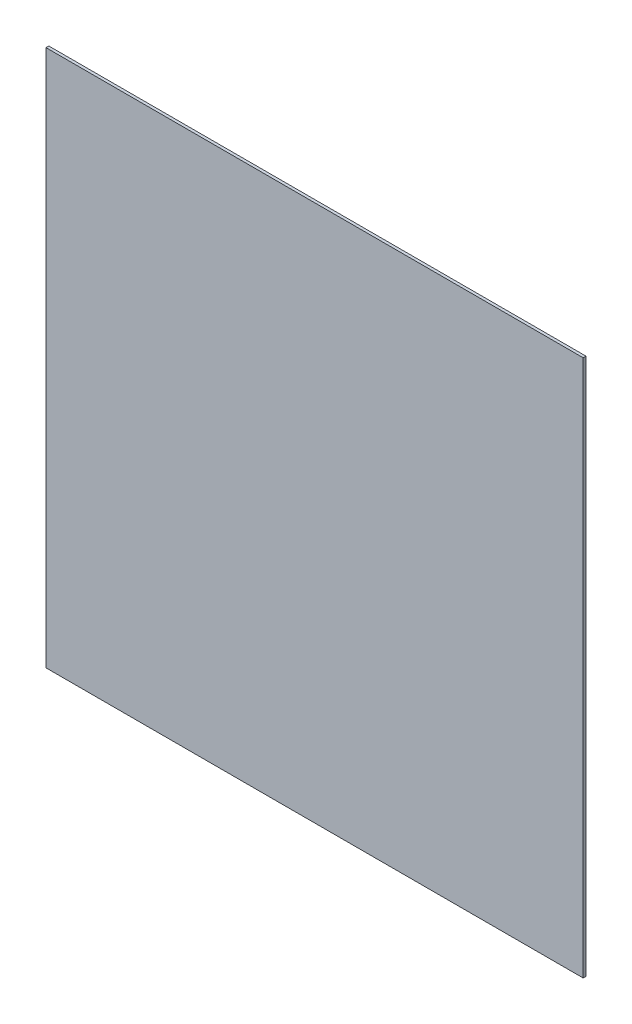
ISO-10303-21;
HEADER;
FILE_DESCRIPTION(('STEP AP214'),'2;1');
FILE_NAME('part.step','',(''),(''),'','','');
FILE_SCHEMA(('AUTOMOTIVE_DESIGN { 1 0 10303 214 1 1 1 1 }'));
ENDSEC;
DATA;
#1=APPLICATION_CONTEXT('core data for automotive mechanical design processes');
#2=APPLICATION_PROTOCOL_DEFINITION('international standard','automotive_design',2000,#1);
#3=PRODUCT_CONTEXT('',#1,'mechanical');
#4=PRODUCT('Part','Part','',(#3));
#5=PRODUCT_RELATED_PRODUCT_CATEGORY('part','',(#4));
#6=PRODUCT_DEFINITION_FORMATION('','',#4);
#7=PRODUCT_DEFINITION_CONTEXT('part definition',#1,'design');
#8=PRODUCT_DEFINITION('design','',#6,#7);
#9=PRODUCT_DEFINITION_SHAPE('','',#8);
#10=(LENGTH_UNIT() NAMED_UNIT(*) SI_UNIT(.MILLI.,.METRE.));
#11=(NAMED_UNIT(*) PLANE_ANGLE_UNIT() SI_UNIT($,.RADIAN.));
#12=(NAMED_UNIT(*) SI_UNIT($,.STERADIAN.) SOLID_ANGLE_UNIT());
#13=UNCERTAINTY_MEASURE_WITH_UNIT(LENGTH_MEASURE(1.E-05),#10,'distance_accuracy_value','');
#14=(GEOMETRIC_REPRESENTATION_CONTEXT(3) GLOBAL_UNCERTAINTY_ASSIGNED_CONTEXT((#13)) GLOBAL_UNIT_ASSIGNED_CONTEXT((#10,
#11,#12)) REPRESENTATION_CONTEXT('',''));
#15=CARTESIAN_POINT('',(0.,0.,0.));
#16=DIRECTION('',(0.,0.,1.));
#17=DIRECTION('',(1.,0.,0.));
#18=AXIS2_PLACEMENT_3D('',#15,#16,#17);
#19=CARTESIAN_POINT('',(-474.,474.,2.5));
#20=DIRECTION('',(1.,0.,0.));
#21=DIRECTION('',(0.,1.,0.));
#22=AXIS2_PLACEMENT_3D('',#19,#20,#21);
#23=PLANE('',#22);
#24=DIRECTION('',(0.,-1.,0.));
#25=VECTOR('',#24,1.);
#26=CARTESIAN_POINT('',(-474.,474.,0.));
#27=LINE('',#26,#25);
#28=CARTESIAN_POINT('',(-474.,474.,0.));
#29=VERTEX_POINT('',#28);
#30=CARTESIAN_POINT('',(-474.,0.,0.));
#31=VERTEX_POINT('',#30);
#32=EDGE_CURVE('E107',#29,#31,#27,.T.);
#33=ORIENTED_EDGE('',*,*,#32,.T.);
#34=DIRECTION('',(0.,0.,-1.));
#35=VECTOR('',#34,1.);
#36=CARTESIAN_POINT('',(-474.,0.,2.5));
#37=LINE('',#36,#35);
#38=CARTESIAN_POINT('',(-474.,0.,2.5));
#39=VERTEX_POINT('',#38);
#40=EDGE_CURVE('E11',#39,#31,#37,.T.);
#41=ORIENTED_EDGE('',*,*,#40,.F.);
#42=DIRECTION('',(0.,-1.,0.));
#43=VECTOR('',#42,1.);
#44=CARTESIAN_POINT('',(-474.,474.,2.5));
#45=LINE('',#44,#43);
#46=CARTESIAN_POINT('',(-474.,474.,2.5));
#47=VERTEX_POINT('',#46);
#48=EDGE_CURVE('E91',#47,#39,#45,.T.);
#49=ORIENTED_EDGE('',*,*,#48,.F.);
#50=DIRECTION('',(0.,0.,-1.));
#51=VECTOR('',#50,1.);
#52=CARTESIAN_POINT('',(-474.,474.,2.5));
#53=LINE('',#52,#51);
#54=EDGE_CURVE('E103',#47,#29,#53,.T.);
#55=ORIENTED_EDGE('',*,*,#54,.T.);
#56=EDGE_LOOP('',(#33,#41,#49,#55));
#57=FACE_BOUND('',#56,.T.);
#58=ADVANCED_FACE('F39',(#57),#23,.F.);
#59=CARTESIAN_POINT('',(-474.,0.,2.5));
#60=DIRECTION('',(0.,1.,0.));
#61=DIRECTION('',(0.,0.,1.));
#62=AXIS2_PLACEMENT_3D('',#59,#60,#61);
#63=PLANE('',#62);
#64=DIRECTION('',(1.,0.,0.));
#65=VECTOR('',#64,1.);
#66=CARTESIAN_POINT('',(-474.,0.,0.));
#67=LINE('',#66,#65);
#68=CARTESIAN_POINT('',(0.,0.,0.));
#69=VERTEX_POINT('',#68);
#70=EDGE_CURVE('E96',#31,#69,#67,.T.);
#71=ORIENTED_EDGE('',*,*,#70,.T.);
#72=DIRECTION('',(0.,0.,-1.));
#73=VECTOR('',#72,1.);
#74=CARTESIAN_POINT('',(0.,0.,2.5));
#75=LINE('',#74,#73);
#76=CARTESIAN_POINT('',(0.,0.,2.5));
#77=VERTEX_POINT('',#76);
#78=EDGE_CURVE('E48',#77,#69,#75,.T.);
#79=ORIENTED_EDGE('',*,*,#78,.F.);
#80=DIRECTION('',(1.,0.,0.));
#81=VECTOR('',#80,1.);
#82=CARTESIAN_POINT('',(-474.,0.,2.5));
#83=LINE('',#82,#81);
#84=EDGE_CURVE('E86',#39,#77,#83,.T.);
#85=ORIENTED_EDGE('',*,*,#84,.F.);
#86=ORIENTED_EDGE('',*,*,#40,.T.);
#87=EDGE_LOOP('',(#71,#79,#85,#86));
#88=FACE_BOUND('',#87,.T.);
#89=ADVANCED_FACE('F95',(#88),#63,.F.);
#90=CARTESIAN_POINT('',(0.,474.,2.5));
#91=DIRECTION('',(-1.,0.,0.));
#92=DIRECTION('',(0.,-1.,0.));
#93=AXIS2_PLACEMENT_3D('',#90,#91,#92);
#94=PLANE('',#93);
#95=DIRECTION('',(0.,1.,0.));
#96=VECTOR('',#95,1.);
#97=CARTESIAN_POINT('',(0.,474.,0.));
#98=LINE('',#97,#96);
#99=CARTESIAN_POINT('',(0.,474.,0.));
#100=VERTEX_POINT('',#99);
#101=EDGE_CURVE('E73',#69,#100,#98,.T.);
#102=ORIENTED_EDGE('',*,*,#101,.T.);
#103=DIRECTION('',(0.,0.,-1.));
#104=VECTOR('',#103,1.);
#105=CARTESIAN_POINT('',(0.,474.,2.5));
#106=LINE('',#105,#104);
#107=CARTESIAN_POINT('',(0.,474.,2.5));
#108=VERTEX_POINT('',#107);
#109=EDGE_CURVE('E98',#108,#100,#106,.T.);
#110=ORIENTED_EDGE('',*,*,#109,.F.);
#111=DIRECTION('',(0.,1.,0.));
#112=VECTOR('',#111,1.);
#113=CARTESIAN_POINT('',(0.,474.,2.5));
#114=LINE('',#113,#112);
#115=EDGE_CURVE('E89',#77,#108,#114,.T.);
#116=ORIENTED_EDGE('',*,*,#115,.F.);
#117=ORIENTED_EDGE('',*,*,#78,.T.);
#118=EDGE_LOOP('',(#102,#110,#116,#117));
#119=FACE_BOUND('',#118,.T.);
#120=ADVANCED_FACE('F99',(#119),#94,.F.);
#121=CARTESIAN_POINT('',(-474.,474.,2.5));
#122=DIRECTION('',(0.,-1.,0.));
#123=DIRECTION('',(0.,0.,-1.));
#124=AXIS2_PLACEMENT_3D('',#121,#122,#123);
#125=PLANE('',#124);
#126=DIRECTION('',(-1.,0.,0.));
#127=VECTOR('',#126,1.);
#128=CARTESIAN_POINT('',(-474.,474.,0.));
#129=LINE('',#128,#127);
#130=EDGE_CURVE('E79',#100,#29,#129,.T.);
#131=ORIENTED_EDGE('',*,*,#130,.T.);
#132=ORIENTED_EDGE('',*,*,#54,.F.);
#133=DIRECTION('',(-1.,0.,0.));
#134=VECTOR('',#133,1.);
#135=CARTESIAN_POINT('',(-474.,474.,2.5));
#136=LINE('',#135,#134);
#137=EDGE_CURVE('E56',#108,#47,#136,.T.);
#138=ORIENTED_EDGE('',*,*,#137,.F.);
#139=ORIENTED_EDGE('',*,*,#109,.T.);
#140=EDGE_LOOP('',(#131,#132,#138,#139));
#141=FACE_BOUND('',#140,.T.);
#142=ADVANCED_FACE('F120',(#141),#125,.F.);
#143=CARTESIAN_POINT('',(0.,0.,2.5));
#144=DIRECTION('',(0.,0.,1.));
#145=DIRECTION('',(1.,0.,0.));
#146=AXIS2_PLACEMENT_3D('',#143,#144,#145);
#147=PLANE('',#146);
#148=ORIENTED_EDGE('',*,*,#48,.T.);
#149=ORIENTED_EDGE('',*,*,#84,.T.);
#150=ORIENTED_EDGE('',*,*,#115,.T.);
#151=ORIENTED_EDGE('',*,*,#137,.T.);
#152=EDGE_LOOP('',(#148,#149,#150,#151));
#153=FACE_BOUND('',#152,.T.);
#154=ADVANCED_FACE('F87',(#153),#147,.T.);
#155=CARTESIAN_POINT('',(0.,0.,0.));
#156=DIRECTION('',(0.,0.,1.));
#157=DIRECTION('',(1.,0.,0.));
#158=AXIS2_PLACEMENT_3D('',#155,#156,#157);
#159=PLANE('',#158);
#160=ORIENTED_EDGE('',*,*,#32,.F.);
#161=ORIENTED_EDGE('',*,*,#130,.F.);
#162=ORIENTED_EDGE('',*,*,#101,.F.);
#163=ORIENTED_EDGE('',*,*,#70,.F.);
#164=EDGE_LOOP('',(#160,#161,#162,#163));
#165=FACE_BOUND('',#164,.T.);
#166=ADVANCED_FACE('F123',(#165),#159,.F.);
#167=CLOSED_SHELL('',(#58,#89,#120,#142,#154,#166));
#168=MANIFOLD_SOLID_BREP('B2',#167);
#169=ADVANCED_BREP_SHAPE_REPRESENTATION('',(#18,#168),#14);
#170=SHAPE_DEFINITION_REPRESENTATION(#9,#169);
ENDSEC;
END-ISO-10303-21;
